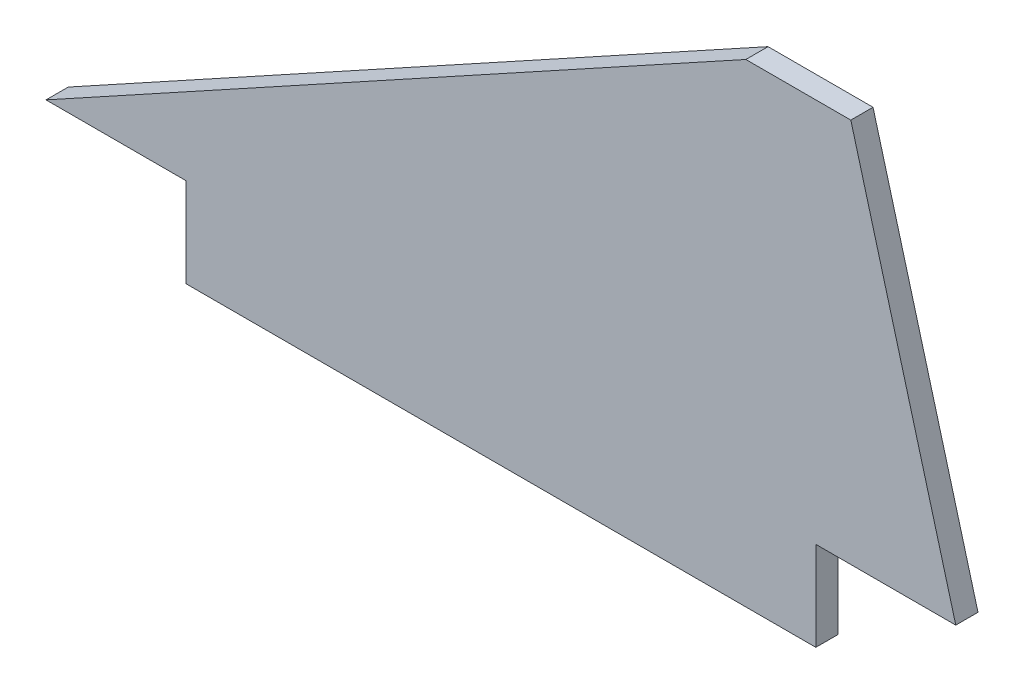
ISO-10303-21;
HEADER;
FILE_DESCRIPTION(('STEP AP214'),'2;1');
FILE_NAME('part.step','',(''),(''),'','','');
FILE_SCHEMA(('AUTOMOTIVE_DESIGN { 1 0 10303 214 1 1 1 1 }'));
ENDSEC;
DATA;
#1=APPLICATION_CONTEXT('core data for automotive mechanical design processes');
#2=APPLICATION_PROTOCOL_DEFINITION('international standard','automotive_design',2000,#1);
#3=PRODUCT_CONTEXT('',#1,'mechanical');
#4=PRODUCT('Part','Part','',(#3));
#5=PRODUCT_RELATED_PRODUCT_CATEGORY('part','',(#4));
#6=PRODUCT_DEFINITION_FORMATION('','',#4);
#7=PRODUCT_DEFINITION_CONTEXT('part definition',#1,'design');
#8=PRODUCT_DEFINITION('design','',#6,#7);
#9=PRODUCT_DEFINITION_SHAPE('','',#8);
#10=(LENGTH_UNIT() NAMED_UNIT(*) SI_UNIT(.MILLI.,.METRE.));
#11=(NAMED_UNIT(*) PLANE_ANGLE_UNIT() SI_UNIT($,.RADIAN.));
#12=(NAMED_UNIT(*) SI_UNIT($,.STERADIAN.) SOLID_ANGLE_UNIT());
#13=UNCERTAINTY_MEASURE_WITH_UNIT(LENGTH_MEASURE(1.E-05),#10,'distance_accuracy_value','');
#14=(GEOMETRIC_REPRESENTATION_CONTEXT(3) GLOBAL_UNCERTAINTY_ASSIGNED_CONTEXT((#13)) GLOBAL_UNIT_ASSIGNED_CONTEXT((#10,
#11,#12)) REPRESENTATION_CONTEXT('',''));
#15=CARTESIAN_POINT('',(0.,0.,0.));
#16=DIRECTION('',(0.,0.,1.));
#17=DIRECTION('',(1.,0.,0.));
#18=AXIS2_PLACEMENT_3D('',#15,#16,#17);
#19=CARTESIAN_POINT('',(100.,55.,3.175));
#20=DIRECTION('',(0.481918749772156,-0.876215908676647,0.));
#21=DIRECTION('',(0.876215908676647,0.481918749772156,0.));
#22=AXIS2_PLACEMENT_3D('',#19,#20,#21);
#23=PLANE('',#22);
#24=DIRECTION('',(-0.876215908676647,-0.481918749772156,0.));
#25=VECTOR('',#24,1.);
#26=CARTESIAN_POINT('',(100.,55.,0.));
#27=LINE('',#26,#25);
#28=CARTESIAN_POINT('',(100.,55.,0.));
#29=VERTEX_POINT('',#28);
#30=CARTESIAN_POINT('',(0.,0.,0.));
#31=VERTEX_POINT('',#30);
#32=EDGE_CURVE('E129',#29,#31,#27,.T.);
#33=ORIENTED_EDGE('',*,*,#32,.T.);
#34=DIRECTION('',(0.,0.,-1.));
#35=VECTOR('',#34,1.);
#36=CARTESIAN_POINT('',(0.,0.,3.175));
#37=LINE('',#36,#35);
#38=CARTESIAN_POINT('',(0.,0.,3.175));
#39=VERTEX_POINT('',#38);
#40=EDGE_CURVE('E11',#39,#31,#37,.T.);
#41=ORIENTED_EDGE('',*,*,#40,.F.);
#42=DIRECTION('',(-0.876215908676647,-0.481918749772156,0.));
#43=VECTOR('',#42,1.);
#44=CARTESIAN_POINT('',(100.,55.,3.175));
#45=LINE('',#44,#43);
#46=CARTESIAN_POINT('',(100.,55.,3.175));
#47=VERTEX_POINT('',#46);
#48=EDGE_CURVE('E143',#47,#39,#45,.T.);
#49=ORIENTED_EDGE('',*,*,#48,.F.);
#50=DIRECTION('',(0.,0.,-1.));
#51=VECTOR('',#50,1.);
#52=CARTESIAN_POINT('',(100.,55.,3.175));
#53=LINE('',#52,#51);
#54=EDGE_CURVE('E125',#47,#29,#53,.T.);
#55=ORIENTED_EDGE('',*,*,#54,.T.);
#56=EDGE_LOOP('',(#33,#41,#49,#55));
#57=FACE_BOUND('',#56,.T.);
#58=ADVANCED_FACE('F33',(#57),#23,.F.);
#59=CARTESIAN_POINT('',(0.,0.,3.175));
#60=DIRECTION('',(0.,1.,0.));
#61=DIRECTION('',(0.,0.,1.));
#62=AXIS2_PLACEMENT_3D('',#59,#60,#61);
#63=PLANE('',#62);
#64=DIRECTION('',(1.,0.,0.));
#65=VECTOR('',#64,1.);
#66=CARTESIAN_POINT('',(0.,0.,0.));
#67=LINE('',#66,#65);
#68=CARTESIAN_POINT('',(20.,0.,0.));
#69=VERTEX_POINT('',#68);
#70=EDGE_CURVE('E132',#31,#69,#67,.T.);
#71=ORIENTED_EDGE('',*,*,#70,.T.);
#72=DIRECTION('',(0.,0.,-1.));
#73=VECTOR('',#72,1.);
#74=CARTESIAN_POINT('',(20.,0.,3.175));
#75=LINE('',#74,#73);
#76=CARTESIAN_POINT('',(20.,0.,3.175));
#77=VERTEX_POINT('',#76);
#78=EDGE_CURVE('E41',#77,#69,#75,.T.);
#79=ORIENTED_EDGE('',*,*,#78,.F.);
#80=DIRECTION('',(1.,0.,0.));
#81=VECTOR('',#80,1.);
#82=CARTESIAN_POINT('',(0.,0.,3.175));
#83=LINE('',#82,#81);
#84=EDGE_CURVE('E92',#39,#77,#83,.T.);
#85=ORIENTED_EDGE('',*,*,#84,.F.);
#86=ORIENTED_EDGE('',*,*,#40,.T.);
#87=EDGE_LOOP('',(#71,#79,#85,#86));
#88=FACE_BOUND('',#87,.T.);
#89=ADVANCED_FACE('F178',(#88),#63,.F.);
#90=CARTESIAN_POINT('',(20.,0.,3.175));
#91=DIRECTION('',(1.,0.,0.));
#92=DIRECTION('',(0.,0.,-1.));
#93=AXIS2_PLACEMENT_3D('',#90,#91,#92);
#94=PLANE('',#93);
#95=DIRECTION('',(0.,-1.,0.));
#96=VECTOR('',#95,1.);
#97=CARTESIAN_POINT('',(20.,0.,0.));
#98=LINE('',#97,#96);
#99=CARTESIAN_POINT('',(20.,-12.75,0.));
#100=VERTEX_POINT('',#99);
#101=EDGE_CURVE('E134',#69,#100,#98,.T.);
#102=ORIENTED_EDGE('',*,*,#101,.T.);
#103=DIRECTION('',(0.,0.,-1.));
#104=VECTOR('',#103,1.);
#105=CARTESIAN_POINT('',(20.,-12.75,3.175));
#106=LINE('',#105,#104);
#107=CARTESIAN_POINT('',(20.,-12.75,3.175));
#108=VERTEX_POINT('',#107);
#109=EDGE_CURVE('E150',#108,#100,#106,.T.);
#110=ORIENTED_EDGE('',*,*,#109,.F.);
#111=DIRECTION('',(0.,-1.,0.));
#112=VECTOR('',#111,1.);
#113=CARTESIAN_POINT('',(20.,0.,3.175));
#114=LINE('',#113,#112);
#115=EDGE_CURVE('E158',#77,#108,#114,.T.);
#116=ORIENTED_EDGE('',*,*,#115,.F.);
#117=ORIENTED_EDGE('',*,*,#78,.T.);
#118=EDGE_LOOP('',(#102,#110,#116,#117));
#119=FACE_BOUND('',#118,.T.);
#120=ADVANCED_FACE('F156',(#119),#94,.F.);
#121=CARTESIAN_POINT('',(20.,-12.75,3.175));
#122=DIRECTION('',(0.,1.,0.));
#123=DIRECTION('',(0.,0.,1.));
#124=AXIS2_PLACEMENT_3D('',#121,#122,#123);
#125=PLANE('',#124);
#126=DIRECTION('',(1.,0.,0.));
#127=VECTOR('',#126,1.);
#128=CARTESIAN_POINT('',(20.,-12.75,0.));
#129=LINE('',#128,#127);
#130=CARTESIAN_POINT('',(110.,-12.75,0.));
#131=VERTEX_POINT('',#130);
#132=EDGE_CURVE('E136',#100,#131,#129,.T.);
#133=ORIENTED_EDGE('',*,*,#132,.T.);
#134=DIRECTION('',(0.,0.,-1.));
#135=VECTOR('',#134,1.);
#136=CARTESIAN_POINT('',(110.,-12.75,3.175));
#137=LINE('',#136,#135);
#138=CARTESIAN_POINT('',(110.,-12.75,3.175));
#139=VERTEX_POINT('',#138);
#140=EDGE_CURVE('E147',#139,#131,#137,.T.);
#141=ORIENTED_EDGE('',*,*,#140,.F.);
#142=DIRECTION('',(1.,0.,0.));
#143=VECTOR('',#142,1.);
#144=CARTESIAN_POINT('',(20.,-12.75,3.175));
#145=LINE('',#144,#143);
#146=EDGE_CURVE('E170',#108,#139,#145,.T.);
#147=ORIENTED_EDGE('',*,*,#146,.F.);
#148=ORIENTED_EDGE('',*,*,#109,.T.);
#149=EDGE_LOOP('',(#133,#141,#147,#148));
#150=FACE_BOUND('',#149,.T.);
#151=ADVANCED_FACE('F166',(#150),#125,.F.);
#152=CARTESIAN_POINT('',(110.,-12.75,3.175));
#153=DIRECTION('',(-1.,0.,0.));
#154=DIRECTION('',(0.,0.,1.));
#155=AXIS2_PLACEMENT_3D('',#152,#153,#154);
#156=PLANE('',#155);
#157=DIRECTION('',(0.,1.,0.));
#158=VECTOR('',#157,1.);
#159=CARTESIAN_POINT('',(110.,-12.75,0.));
#160=LINE('',#159,#158);
#161=CARTESIAN_POINT('',(110.,0.,0.));
#162=VERTEX_POINT('',#161);
#163=EDGE_CURVE('E138',#131,#162,#160,.T.);
#164=ORIENTED_EDGE('',*,*,#163,.T.);
#165=DIRECTION('',(0.,0.,-1.));
#166=VECTOR('',#165,1.);
#167=CARTESIAN_POINT('',(110.,0.,3.175));
#168=LINE('',#167,#166);
#169=CARTESIAN_POINT('',(110.,0.,3.175));
#170=VERTEX_POINT('',#169);
#171=EDGE_CURVE('E120',#170,#162,#168,.T.);
#172=ORIENTED_EDGE('',*,*,#171,.F.);
#173=DIRECTION('',(0.,1.,0.));
#174=VECTOR('',#173,1.);
#175=CARTESIAN_POINT('',(110.,-12.75,3.175));
#176=LINE('',#175,#174);
#177=EDGE_CURVE('E111',#139,#170,#176,.T.);
#178=ORIENTED_EDGE('',*,*,#177,.F.);
#179=ORIENTED_EDGE('',*,*,#140,.T.);
#180=EDGE_LOOP('',(#164,#172,#178,#179));
#181=FACE_BOUND('',#180,.T.);
#182=ADVANCED_FACE('F169',(#181),#156,.F.);
#183=CARTESIAN_POINT('',(110.,0.,3.175));
#184=DIRECTION('',(0.,1.,0.));
#185=DIRECTION('',(0.,0.,1.));
#186=AXIS2_PLACEMENT_3D('',#183,#184,#185);
#187=PLANE('',#186);
#188=DIRECTION('',(1.,0.,0.));
#189=VECTOR('',#188,1.);
#190=CARTESIAN_POINT('',(110.,0.,0.));
#191=LINE('',#190,#189);
#192=CARTESIAN_POINT('',(130.,0.,0.));
#193=VERTEX_POINT('',#192);
#194=EDGE_CURVE('E119',#162,#193,#191,.T.);
#195=ORIENTED_EDGE('',*,*,#194,.T.);
#196=DIRECTION('',(0.,0.,-1.));
#197=VECTOR('',#196,1.);
#198=CARTESIAN_POINT('',(130.,0.,3.175));
#199=LINE('',#198,#197);
#200=CARTESIAN_POINT('',(130.,0.,3.175));
#201=VERTEX_POINT('',#200);
#202=EDGE_CURVE('E116',#201,#193,#199,.T.);
#203=ORIENTED_EDGE('',*,*,#202,.F.);
#204=DIRECTION('',(1.,0.,0.));
#205=VECTOR('',#204,1.);
#206=CARTESIAN_POINT('',(110.,0.,3.175));
#207=LINE('',#206,#205);
#208=EDGE_CURVE('E105',#170,#201,#207,.T.);
#209=ORIENTED_EDGE('',*,*,#208,.F.);
#210=ORIENTED_EDGE('',*,*,#171,.T.);
#211=EDGE_LOOP('',(#195,#203,#209,#210));
#212=FACE_BOUND('',#211,.T.);
#213=ADVANCED_FACE('F117',(#212),#187,.F.);
#214=CARTESIAN_POINT('',(130.,0.,3.175));
#215=DIRECTION('',(-0.964763821237732,-0.263117405792109,0.));
#216=DIRECTION('',(0.263117405792109,-0.964763821237732,0.));
#217=AXIS2_PLACEMENT_3D('',#214,#215,#216);
#218=PLANE('',#217);
#219=DIRECTION('',(-0.263117405792109,0.964763821237732,0.));
#220=VECTOR('',#219,1.);
#221=CARTESIAN_POINT('',(130.,0.,0.));
#222=LINE('',#221,#220);
#223=CARTESIAN_POINT('',(115.,55.,0.));
#224=VERTEX_POINT('',#223);
#225=EDGE_CURVE('E78',#193,#224,#222,.T.);
#226=ORIENTED_EDGE('',*,*,#225,.T.);
#227=DIRECTION('',(0.,0.,-1.));
#228=VECTOR('',#227,1.);
#229=CARTESIAN_POINT('',(115.,55.,3.175));
#230=LINE('',#229,#228);
#231=CARTESIAN_POINT('',(115.,55.,3.175));
#232=VERTEX_POINT('',#231);
#233=EDGE_CURVE('E121',#232,#224,#230,.T.);
#234=ORIENTED_EDGE('',*,*,#233,.F.);
#235=DIRECTION('',(-0.263117405792109,0.964763821237732,0.));
#236=VECTOR('',#235,1.);
#237=CARTESIAN_POINT('',(130.,0.,3.175));
#238=LINE('',#237,#236);
#239=EDGE_CURVE('E109',#201,#232,#238,.T.);
#240=ORIENTED_EDGE('',*,*,#239,.F.);
#241=ORIENTED_EDGE('',*,*,#202,.T.);
#242=EDGE_LOOP('',(#226,#234,#240,#241));
#243=FACE_BOUND('',#242,.T.);
#244=ADVANCED_FACE('F123',(#243),#218,.F.);
#245=CARTESIAN_POINT('',(115.,55.,3.175));
#246=DIRECTION('',(0.,-1.,0.));
#247=DIRECTION('',(0.,0.,-1.));
#248=AXIS2_PLACEMENT_3D('',#245,#246,#247);
#249=PLANE('',#248);
#250=DIRECTION('',(-1.,0.,0.));
#251=VECTOR('',#250,1.);
#252=CARTESIAN_POINT('',(115.,55.,0.));
#253=LINE('',#252,#251);
#254=EDGE_CURVE('E84',#224,#29,#253,.T.);
#255=ORIENTED_EDGE('',*,*,#254,.T.);
#256=ORIENTED_EDGE('',*,*,#54,.F.);
#257=DIRECTION('',(-1.,0.,0.));
#258=VECTOR('',#257,1.);
#259=CARTESIAN_POINT('',(115.,55.,3.175));
#260=LINE('',#259,#258);
#261=EDGE_CURVE('E49',#232,#47,#260,.T.);
#262=ORIENTED_EDGE('',*,*,#261,.F.);
#263=ORIENTED_EDGE('',*,*,#233,.T.);
#264=EDGE_LOOP('',(#255,#256,#262,#263));
#265=FACE_BOUND('',#264,.T.);
#266=ADVANCED_FACE('F194',(#265),#249,.F.);
#267=CARTESIAN_POINT('',(0.,0.,3.175));
#268=DIRECTION('',(0.,0.,-1.));
#269=DIRECTION('',(-1.,0.,0.));
#270=AXIS2_PLACEMENT_3D('',#267,#268,#269);
#271=PLANE('',#270);
#272=ORIENTED_EDGE('',*,*,#48,.T.);
#273=ORIENTED_EDGE('',*,*,#84,.T.);
#274=ORIENTED_EDGE('',*,*,#115,.T.);
#275=ORIENTED_EDGE('',*,*,#146,.T.);
#276=ORIENTED_EDGE('',*,*,#177,.T.);
#277=ORIENTED_EDGE('',*,*,#208,.T.);
#278=ORIENTED_EDGE('',*,*,#239,.T.);
#279=ORIENTED_EDGE('',*,*,#261,.T.);
#280=EDGE_LOOP('',(#272,#273,#274,#275,#276,#277,#278,#279));
#281=FACE_BOUND('',#280,.T.);
#282=ADVANCED_FACE('F107',(#281),#271,.F.);
#283=CARTESIAN_POINT('',(0.,0.,0.));
#284=DIRECTION('',(0.,0.,-1.));
#285=DIRECTION('',(-1.,0.,0.));
#286=AXIS2_PLACEMENT_3D('',#283,#284,#285);
#287=PLANE('',#286);
#288=ORIENTED_EDGE('',*,*,#32,.F.);
#289=ORIENTED_EDGE('',*,*,#254,.F.);
#290=ORIENTED_EDGE('',*,*,#225,.F.);
#291=ORIENTED_EDGE('',*,*,#194,.F.);
#292=ORIENTED_EDGE('',*,*,#163,.F.);
#293=ORIENTED_EDGE('',*,*,#132,.F.);
#294=ORIENTED_EDGE('',*,*,#101,.F.);
#295=ORIENTED_EDGE('',*,*,#70,.F.);
#296=EDGE_LOOP('',(#288,#289,#290,#291,#292,#293,#294,#295));
#297=FACE_BOUND('',#296,.T.);
#298=ADVANCED_FACE('F162',(#297),#287,.T.);
#299=CLOSED_SHELL('',(#58,#89,#120,#151,#182,#213,#244,#266,#282,#298));
#300=MANIFOLD_SOLID_BREP('B2',#299);
#301=ADVANCED_BREP_SHAPE_REPRESENTATION('',(#18,#300),#14);
#302=SHAPE_DEFINITION_REPRESENTATION(#9,#301);
ENDSEC;
END-ISO-10303-21;
